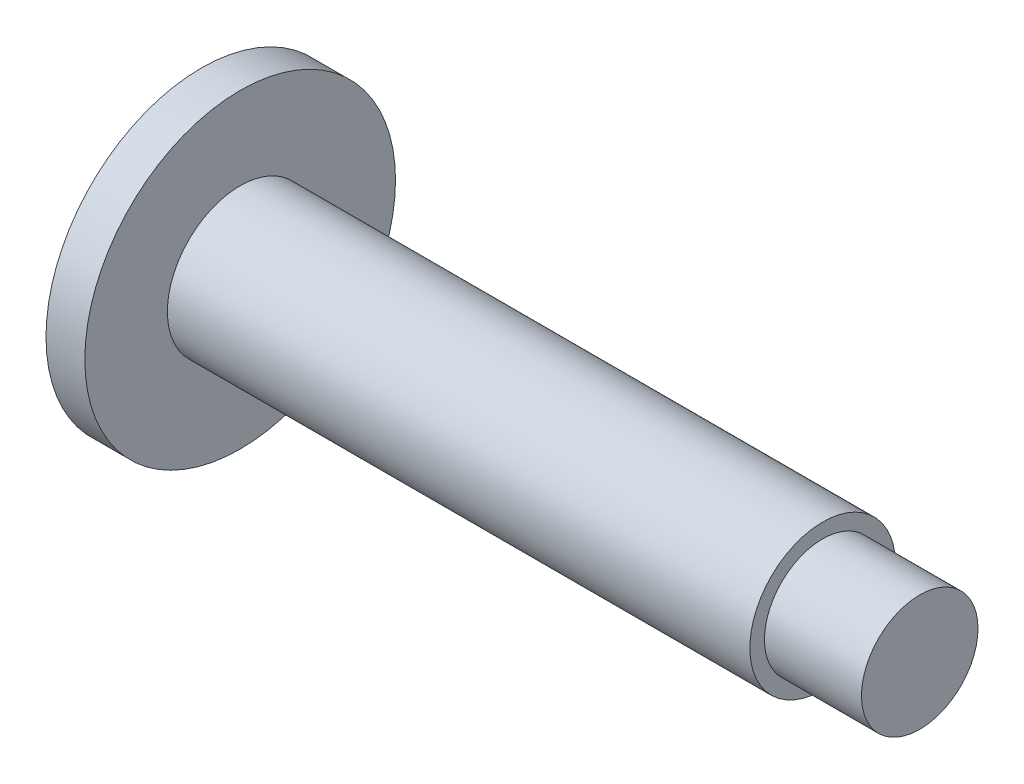
ISO-10303-21;
HEADER;
FILE_DESCRIPTION(('STEP AP214'),'2;1');
FILE_NAME('part.step','',(''),(''),'','','');
FILE_SCHEMA(('AUTOMOTIVE_DESIGN { 1 0 10303 214 1 1 1 1 }'));
ENDSEC;
DATA;
#1=APPLICATION_CONTEXT('core data for automotive mechanical design processes');
#2=APPLICATION_PROTOCOL_DEFINITION('international standard','automotive_design',2000,#1);
#3=PRODUCT_CONTEXT('',#1,'mechanical');
#4=PRODUCT('Part','Part','',(#3));
#5=PRODUCT_RELATED_PRODUCT_CATEGORY('part','',(#4));
#6=PRODUCT_DEFINITION_FORMATION('','',#4);
#7=PRODUCT_DEFINITION_CONTEXT('part definition',#1,'design');
#8=PRODUCT_DEFINITION('design','',#6,#7);
#9=PRODUCT_DEFINITION_SHAPE('','',#8);
#10=(LENGTH_UNIT() NAMED_UNIT(*) SI_UNIT(.MILLI.,.METRE.));
#11=(NAMED_UNIT(*) PLANE_ANGLE_UNIT() SI_UNIT($,.RADIAN.));
#12=(NAMED_UNIT(*) SI_UNIT($,.STERADIAN.) SOLID_ANGLE_UNIT());
#13=UNCERTAINTY_MEASURE_WITH_UNIT(LENGTH_MEASURE(1.E-05),#10,'distance_accuracy_value','');
#14=(GEOMETRIC_REPRESENTATION_CONTEXT(3) GLOBAL_UNCERTAINTY_ASSIGNED_CONTEXT((#13)) GLOBAL_UNIT_ASSIGNED_CONTEXT((#10,
#11,#12)) REPRESENTATION_CONTEXT('',''));
#15=CARTESIAN_POINT('',(0.,0.,0.));
#16=DIRECTION('',(0.,0.,1.));
#17=DIRECTION('',(1.,0.,0.));
#18=AXIS2_PLACEMENT_3D('',#15,#16,#17);
#19=CARTESIAN_POINT('',(2.,0.,0.));
#20=DIRECTION('',(-1.,0.,0.));
#21=DIRECTION('',(0.,0.,1.));
#22=AXIS2_PLACEMENT_3D('',#19,#20,#21);
#23=CYLINDRICAL_SURFACE('',#22,8.);
#24=CARTESIAN_POINT('',(2.,0.,0.));
#25=DIRECTION('',(1.,0.,0.));
#26=DIRECTION('',(0.,0.,-1.));
#27=AXIS2_PLACEMENT_3D('',#24,#25,#26);
#28=CIRCLE('',#27,8.);
#29=CARTESIAN_POINT('',(2.,0.,-8.));
#30=VERTEX_POINT('',#29);
#31=EDGE_CURVE('E55',#30,#30,#28,.T.);
#32=ORIENTED_EDGE('',*,*,#31,.F.);
#33=EDGE_LOOP('',(#32));
#34=FACE_BOUND('',#33,.T.);
#35=CARTESIAN_POINT('',(0.,0.,0.));
#36=DIRECTION('',(1.,0.,0.));
#37=DIRECTION('',(0.,0.,-1.));
#38=AXIS2_PLACEMENT_3D('',#35,#36,#37);
#39=CIRCLE('',#38,8.);
#40=CARTESIAN_POINT('',(0.,0.,-8.));
#41=VERTEX_POINT('',#40);
#42=EDGE_CURVE('E46',#41,#41,#39,.T.);
#43=ORIENTED_EDGE('',*,*,#42,.T.);
#44=EDGE_LOOP('',(#43));
#45=FACE_BOUND('',#44,.T.);
#46=ADVANCED_FACE('F43',(#34,#45),#23,.T.);
#47=CARTESIAN_POINT('',(2.,0.,0.));
#48=DIRECTION('',(1.,0.,0.));
#49=DIRECTION('',(0.,0.,-1.));
#50=AXIS2_PLACEMENT_3D('',#47,#48,#49);
#51=PLANE('',#50);
#52=CARTESIAN_POINT('',(2.,0.,0.));
#53=DIRECTION('',(1.,0.,0.));
#54=DIRECTION('',(0.,0.,-1.));
#55=AXIS2_PLACEMENT_3D('',#52,#53,#54);
#56=CIRCLE('',#55,3.75);
#57=CARTESIAN_POINT('',(2.,0.,-3.75));
#58=VERTEX_POINT('',#57);
#59=EDGE_CURVE('E50',#58,#58,#56,.T.);
#60=ORIENTED_EDGE('',*,*,#59,.F.);
#61=EDGE_LOOP('',(#60));
#62=FACE_BOUND('',#61,.T.);
#63=ORIENTED_EDGE('',*,*,#31,.T.);
#64=EDGE_LOOP('',(#63));
#65=FACE_BOUND('',#64,.T.);
#66=ADVANCED_FACE('F72',(#62,#65),#51,.T.);
#67=CARTESIAN_POINT('',(0.,0.,0.));
#68=DIRECTION('',(1.,0.,0.));
#69=DIRECTION('',(0.,0.,-1.));
#70=AXIS2_PLACEMENT_3D('',#67,#68,#69);
#71=PLANE('',#70);
#72=ORIENTED_EDGE('',*,*,#42,.F.);
#73=EDGE_LOOP('',(#72));
#74=FACE_BOUND('',#73,.T.);
#75=ADVANCED_FACE('F69',(#74),#71,.F.);
#76=CARTESIAN_POINT('',(32.,0.,0.));
#77=DIRECTION('',(-1.,0.,0.));
#78=DIRECTION('',(0.,0.,1.));
#79=AXIS2_PLACEMENT_3D('',#76,#77,#78);
#80=CYLINDRICAL_SURFACE('',#79,3.75);
#81=CARTESIAN_POINT('',(32.,0.,0.));
#82=DIRECTION('',(1.,0.,0.));
#83=DIRECTION('',(0.,0.,-1.));
#84=AXIS2_PLACEMENT_3D('',#81,#82,#83);
#85=CIRCLE('',#84,3.75);
#86=CARTESIAN_POINT('',(32.,0.,-3.75));
#87=VERTEX_POINT('',#86);
#88=EDGE_CURVE('E60',#87,#87,#85,.T.);
#89=ORIENTED_EDGE('',*,*,#88,.F.);
#90=EDGE_LOOP('',(#89));
#91=FACE_BOUND('',#90,.T.);
#92=ORIENTED_EDGE('',*,*,#59,.T.);
#93=EDGE_LOOP('',(#92));
#94=FACE_BOUND('',#93,.T.);
#95=ADVANCED_FACE('F71',(#91,#94),#80,.T.);
#96=CARTESIAN_POINT('',(32.,0.,0.));
#97=DIRECTION('',(1.,0.,0.));
#98=DIRECTION('',(0.,0.,-1.));
#99=AXIS2_PLACEMENT_3D('',#96,#97,#98);
#100=PLANE('',#99);
#101=CARTESIAN_POINT('',(32.,0.,0.));
#102=DIRECTION('',(1.,0.,0.));
#103=DIRECTION('',(0.,0.,-1.));
#104=AXIS2_PLACEMENT_3D('',#101,#102,#103);
#105=CIRCLE('',#104,3.);
#106=CARTESIAN_POINT('',(32.,0.,-3.));
#107=VERTEX_POINT('',#106);
#108=EDGE_CURVE('E12',#107,#107,#105,.T.);
#109=ORIENTED_EDGE('',*,*,#108,.F.);
#110=EDGE_LOOP('',(#109));
#111=FACE_BOUND('',#110,.T.);
#112=ORIENTED_EDGE('',*,*,#88,.T.);
#113=EDGE_LOOP('',(#112));
#114=FACE_BOUND('',#113,.T.);
#115=ADVANCED_FACE('F77',(#111,#114),#100,.T.);
#116=CARTESIAN_POINT('',(37.,0.,0.));
#117=DIRECTION('',(-1.,0.,0.));
#118=DIRECTION('',(0.,0.,1.));
#119=AXIS2_PLACEMENT_3D('',#116,#117,#118);
#120=CYLINDRICAL_SURFACE('',#119,3.);
#121=CARTESIAN_POINT('',(37.,0.,0.));
#122=DIRECTION('',(1.,0.,0.));
#123=DIRECTION('',(0.,0.,-1.));
#124=AXIS2_PLACEMENT_3D('',#121,#122,#123);
#125=CIRCLE('',#124,3.);
#126=CARTESIAN_POINT('',(37.,0.,-3.));
#127=VERTEX_POINT('',#126);
#128=EDGE_CURVE('E59',#127,#127,#125,.T.);
#129=ORIENTED_EDGE('',*,*,#128,.F.);
#130=EDGE_LOOP('',(#129));
#131=FACE_BOUND('',#130,.T.);
#132=ORIENTED_EDGE('',*,*,#108,.T.);
#133=EDGE_LOOP('',(#132));
#134=FACE_BOUND('',#133,.T.);
#135=ADVANCED_FACE('F107',(#131,#134),#120,.T.);
#136=CARTESIAN_POINT('',(37.,0.,0.));
#137=DIRECTION('',(1.,0.,0.));
#138=DIRECTION('',(0.,0.,-1.));
#139=AXIS2_PLACEMENT_3D('',#136,#137,#138);
#140=PLANE('',#139);
#141=ORIENTED_EDGE('',*,*,#128,.T.);
#142=EDGE_LOOP('',(#141));
#143=FACE_BOUND('',#142,.T.);
#144=ADVANCED_FACE('F117',(#143),#140,.T.);
#145=CLOSED_SHELL('',(#46,#66,#75,#95,#115,#135,#144));
#146=MANIFOLD_SOLID_BREP('B2',#145);
#147=ADVANCED_BREP_SHAPE_REPRESENTATION('',(#18,#146),#14);
#148=SHAPE_DEFINITION_REPRESENTATION(#9,#147);
ENDSEC;
END-ISO-10303-21;
